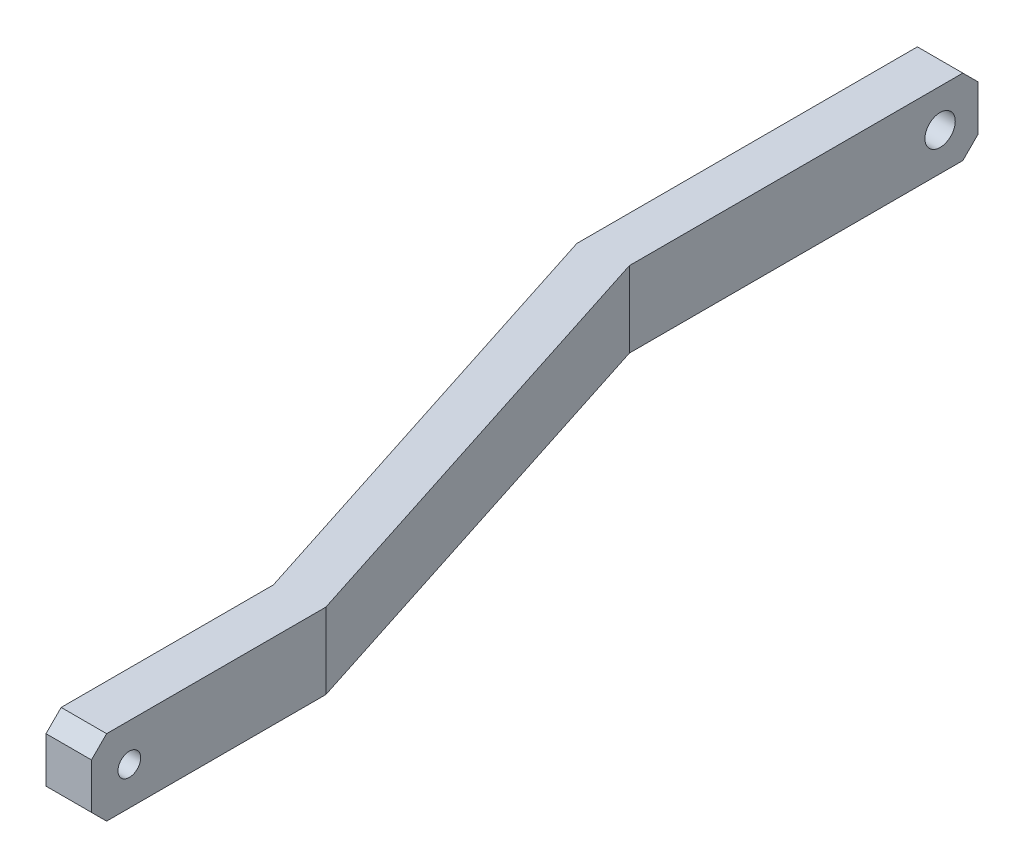
ISO-10303-21;
HEADER;
FILE_DESCRIPTION(('STEP AP214'),'2;1');
FILE_NAME('part.step','',(''),(''),'','','');
FILE_SCHEMA(('AUTOMOTIVE_DESIGN { 1 0 10303 214 1 1 1 1 }'));
ENDSEC;
DATA;
#1=APPLICATION_CONTEXT('core data for automotive mechanical design processes');
#2=APPLICATION_PROTOCOL_DEFINITION('international standard','automotive_design',2000,#1);
#3=PRODUCT_CONTEXT('',#1,'mechanical');
#4=PRODUCT('Part','Part','',(#3));
#5=PRODUCT_RELATED_PRODUCT_CATEGORY('part','',(#4));
#6=PRODUCT_DEFINITION_FORMATION('','',#4);
#7=PRODUCT_DEFINITION_CONTEXT('part definition',#1,'design');
#8=PRODUCT_DEFINITION('design','',#6,#7);
#9=PRODUCT_DEFINITION_SHAPE('','',#8);
#10=(LENGTH_UNIT() NAMED_UNIT(*) SI_UNIT(.MILLI.,.METRE.));
#11=(NAMED_UNIT(*) PLANE_ANGLE_UNIT() SI_UNIT($,.RADIAN.));
#12=(NAMED_UNIT(*) SI_UNIT($,.STERADIAN.) SOLID_ANGLE_UNIT());
#13=UNCERTAINTY_MEASURE_WITH_UNIT(LENGTH_MEASURE(1.E-05),#10,'distance_accuracy_value','');
#14=(GEOMETRIC_REPRESENTATION_CONTEXT(3) GLOBAL_UNCERTAINTY_ASSIGNED_CONTEXT((#13)) GLOBAL_UNIT_ASSIGNED_CONTEXT((#10,
#11,#12)) REPRESENTATION_CONTEXT('',''));
#15=CARTESIAN_POINT('',(0.,0.,0.));
#16=DIRECTION('',(0.,0.,1.));
#17=DIRECTION('',(1.,0.,0.));
#18=AXIS2_PLACEMENT_3D('',#15,#16,#17);
#19=CARTESIAN_POINT('',(-3.,5.,0.));
#20=DIRECTION('',(0.,0.,-1.));
#21=DIRECTION('',(-1.,0.,0.));
#22=AXIS2_PLACEMENT_3D('',#19,#20,#21);
#23=PLANE('',#22);
#24=DIRECTION('',(0.,-1.,0.));
#25=VECTOR('',#24,1.);
#26=CARTESIAN_POINT('',(-3.,5.,0.));
#27=LINE('',#26,#25);
#28=CARTESIAN_POINT('',(-3.,3.99999999999999,0.));
#29=VERTEX_POINT('',#28);
#30=CARTESIAN_POINT('',(-3.,1.00000000000001,0.));
#31=VERTEX_POINT('',#30);
#32=EDGE_CURVE('E159',#29,#31,#27,.T.);
#33=ORIENTED_EDGE('',*,*,#32,.T.);
#34=DIRECTION('',(1.,0.,0.));
#35=VECTOR('',#34,1.);
#36=CARTESIAN_POINT('',(-3.,1.00000000000001,0.));
#37=LINE('',#36,#35);
#38=CARTESIAN_POINT('',(0.,1.00000000000001,0.));
#39=VERTEX_POINT('',#38);
#40=EDGE_CURVE('E189',#31,#39,#37,.T.);
#41=ORIENTED_EDGE('',*,*,#40,.T.);
#42=DIRECTION('',(0.,-1.,0.));
#43=VECTOR('',#42,1.);
#44=CARTESIAN_POINT('',(0.,5.,0.));
#45=LINE('',#44,#43);
#46=CARTESIAN_POINT('',(0.,3.99999999999999,0.));
#47=VERTEX_POINT('',#46);
#48=EDGE_CURVE('E142',#47,#39,#45,.T.);
#49=ORIENTED_EDGE('',*,*,#48,.F.);
#50=DIRECTION('',(-1.,0.,0.));
#51=VECTOR('',#50,1.);
#52=CARTESIAN_POINT('',(-3.,3.99999999999999,0.));
#53=LINE('',#52,#51);
#54=EDGE_CURVE('E187',#47,#29,#53,.T.);
#55=ORIENTED_EDGE('',*,*,#54,.T.);
#56=EDGE_LOOP('',(#33,#41,#49,#55));
#57=FACE_BOUND('',#56,.T.);
#58=ADVANCED_FACE('F32',(#57),#23,.F.);
#59=CARTESIAN_POINT('',(0.,5.,0.));
#60=DIRECTION('',(-1.,0.,0.));
#61=DIRECTION('',(0.,0.,1.));
#62=AXIS2_PLACEMENT_3D('',#59,#60,#61);
#63=PLANE('',#62);
#64=CARTESIAN_POINT('',(0.,2.5,-2.5));
#65=DIRECTION('',(-1.,0.,0.));
#66=DIRECTION('',(0.,0.,1.));
#67=AXIS2_PLACEMENT_3D('',#64,#65,#66);
#68=CIRCLE('',#67,0.75);
#69=CARTESIAN_POINT('',(0.,2.5,-1.75));
#70=VERTEX_POINT('',#69);
#71=EDGE_CURVE('E162',#70,#70,#68,.T.);
#72=ORIENTED_EDGE('',*,*,#71,.T.);
#73=EDGE_LOOP('',(#72));
#74=FACE_BOUND('',#73,.T.);
#75=ORIENTED_EDGE('',*,*,#48,.T.);
#76=DIRECTION('',(0.,0.707106781186548,0.707106781186548));
#77=VECTOR('',#76,1.);
#78=CARTESIAN_POINT('',(0.,1.00000000000001,0.));
#79=LINE('',#78,#77);
#80=CARTESIAN_POINT('',(0.,0.,-1.00000000000001));
#81=VERTEX_POINT('',#80);
#82=EDGE_CURVE('E194',#39,#81,#79,.F.);
#83=ORIENTED_EDGE('',*,*,#82,.T.);
#84=DIRECTION('',(0.,0.,-1.));
#85=VECTOR('',#84,1.);
#86=CARTESIAN_POINT('',(0.,0.,0.));
#87=LINE('',#86,#85);
#88=CARTESIAN_POINT('',(0.,0.,-15.4706920635259));
#89=VERTEX_POINT('',#88);
#90=EDGE_CURVE('E139',#81,#89,#87,.T.);
#91=ORIENTED_EDGE('',*,*,#90,.T.);
#92=DIRECTION('',(0.,-1.,0.));
#93=VECTOR('',#92,1.);
#94=CARTESIAN_POINT('',(0.,5.,-15.4706920635259));
#95=LINE('',#94,#93);
#96=CARTESIAN_POINT('',(0.,5.,-15.4706920635259));
#97=VERTEX_POINT('',#96);
#98=EDGE_CURVE('E135',#97,#89,#95,.T.);
#99=ORIENTED_EDGE('',*,*,#98,.F.);
#100=DIRECTION('',(0.,0.,-1.));
#101=VECTOR('',#100,1.);
#102=CARTESIAN_POINT('',(0.,5.,0.));
#103=LINE('',#102,#101);
#104=CARTESIAN_POINT('',(0.,5.,-1.00000000000001));
#105=VERTEX_POINT('',#104);
#106=EDGE_CURVE('E121',#105,#97,#103,.T.);
#107=ORIENTED_EDGE('',*,*,#106,.F.);
#108=DIRECTION('',(0.,-0.707106781186548,0.707106781186548));
#109=VECTOR('',#108,1.);
#110=CARTESIAN_POINT('',(0.,5.,-1.00000000000001));
#111=LINE('',#110,#109);
#112=EDGE_CURVE('E192',#105,#47,#111,.T.);
#113=ORIENTED_EDGE('',*,*,#112,.T.);
#114=EDGE_LOOP('',(#75,#83,#91,#99,#107,#113));
#115=FACE_BOUND('',#114,.T.);
#116=ADVANCED_FACE('F137',(#74,#115),#63,.F.);
#117=CARTESIAN_POINT('',(0.,5.,-15.4706920635259));
#118=DIRECTION('',(-0.95194929394896,0.,0.306255680355608));
#119=DIRECTION('',(0.306255680355608,0.,0.95194929394896));
#120=AXIS2_PLACEMENT_3D('',#117,#118,#119);
#121=PLANE('',#120);
#122=DIRECTION('',(-0.306255680355608,0.,-0.95194929394896));
#123=VECTOR('',#122,1.);
#124=CARTESIAN_POINT('',(0.,0.,-15.4706920635259));
#125=LINE('',#124,#123);
#126=CARTESIAN_POINT('',(-9.5,0.,-45.));
#127=VERTEX_POINT('',#126);
#128=EDGE_CURVE('E161',#89,#127,#125,.T.);
#129=ORIENTED_EDGE('',*,*,#128,.T.);
#130=DIRECTION('',(0.,-1.,0.));
#131=VECTOR('',#130,1.);
#132=CARTESIAN_POINT('',(-9.5,5.,-45.));
#133=LINE('',#132,#131);
#134=CARTESIAN_POINT('',(-9.5,5.,-45.));
#135=VERTEX_POINT('',#134);
#136=EDGE_CURVE('E143',#135,#127,#133,.T.);
#137=ORIENTED_EDGE('',*,*,#136,.F.);
#138=DIRECTION('',(-0.306255680355608,0.,-0.95194929394896));
#139=VECTOR('',#138,1.);
#140=CARTESIAN_POINT('',(0.,5.,-15.4706920635259));
#141=LINE('',#140,#139);
#142=EDGE_CURVE('E127',#97,#135,#141,.T.);
#143=ORIENTED_EDGE('',*,*,#142,.F.);
#144=ORIENTED_EDGE('',*,*,#98,.T.);
#145=EDGE_LOOP('',(#129,#137,#143,#144));
#146=FACE_BOUND('',#145,.T.);
#147=ADVANCED_FACE('F145',(#146),#121,.F.);
#148=CARTESIAN_POINT('',(-9.5,5.,-45.));
#149=DIRECTION('',(-1.,0.,0.));
#150=DIRECTION('',(0.,0.,1.));
#151=AXIS2_PLACEMENT_3D('',#148,#149,#150);
#152=PLANE('',#151);
#153=CARTESIAN_POINT('',(-9.5,2.5,-65.5));
#154=DIRECTION('',(1.,0.,0.));
#155=DIRECTION('',(0.,0.,-1.));
#156=AXIS2_PLACEMENT_3D('',#153,#154,#155);
#157=CIRCLE('',#156,0.999999999999998);
#158=CARTESIAN_POINT('',(-9.5,2.5,-66.5));
#159=VERTEX_POINT('',#158);
#160=EDGE_CURVE('E382',#159,#159,#157,.T.);
#161=ORIENTED_EDGE('',*,*,#160,.F.);
#162=EDGE_LOOP('',(#161));
#163=FACE_BOUND('',#162,.T.);
#164=DIRECTION('',(0.,-1.,0.));
#165=VECTOR('',#164,1.);
#166=CARTESIAN_POINT('',(-9.5,5.,-68.));
#167=LINE('',#166,#165);
#168=CARTESIAN_POINT('',(-9.5,4.00000000000001,-68.));
#169=VERTEX_POINT('',#168);
#170=CARTESIAN_POINT('',(-9.5,1.00000000000001,-68.));
#171=VERTEX_POINT('',#170);
#172=EDGE_CURVE('E183',#169,#171,#167,.T.);
#173=ORIENTED_EDGE('',*,*,#172,.F.);
#174=DIRECTION('',(0.,0.707106781186545,0.70710678118655));
#175=VECTOR('',#174,1.);
#176=CARTESIAN_POINT('',(-9.5,5.,-67.));
#177=LINE('',#176,#175);
#178=CARTESIAN_POINT('',(-9.5,5.,-67.));
#179=VERTEX_POINT('',#178);
#180=EDGE_CURVE('E11',#169,#179,#177,.T.);
#181=ORIENTED_EDGE('',*,*,#180,.T.);
#182=DIRECTION('',(0.,0.,-1.));
#183=VECTOR('',#182,1.);
#184=CARTESIAN_POINT('',(-9.5,5.,-45.));
#185=LINE('',#184,#183);
#186=EDGE_CURVE('E148',#135,#179,#185,.T.);
#187=ORIENTED_EDGE('',*,*,#186,.F.);
#188=ORIENTED_EDGE('',*,*,#136,.T.);
#189=DIRECTION('',(0.,0.,-1.));
#190=VECTOR('',#189,1.);
#191=CARTESIAN_POINT('',(-9.5,0.,-45.));
#192=LINE('',#191,#190);
#193=CARTESIAN_POINT('',(-9.5,0.,-67.));
#194=VERTEX_POINT('',#193);
#195=EDGE_CURVE('E164',#127,#194,#192,.T.);
#196=ORIENTED_EDGE('',*,*,#195,.T.);
#197=DIRECTION('',(0.,-0.70710678118655,0.707106781186545));
#198=VECTOR('',#197,1.);
#199=CARTESIAN_POINT('',(-9.5,1.00000000000001,-68.));
#200=LINE('',#199,#198);
#201=EDGE_CURVE('E40',#194,#171,#200,.F.);
#202=ORIENTED_EDGE('',*,*,#201,.T.);
#203=EDGE_LOOP('',(#173,#181,#187,#188,#196,#202));
#204=FACE_BOUND('',#203,.T.);
#205=ADVANCED_FACE('F227',(#163,#204),#152,.F.);
#206=CARTESIAN_POINT('',(-9.5,5.,-68.));
#207=DIRECTION('',(0.,0.,1.));
#208=DIRECTION('',(1.,0.,0.));
#209=AXIS2_PLACEMENT_3D('',#206,#207,#208);
#210=PLANE('',#209);
#211=DIRECTION('',(0.,-1.,0.));
#212=VECTOR('',#211,1.);
#213=CARTESIAN_POINT('',(-12.5,5.,-68.));
#214=LINE('',#213,#212);
#215=CARTESIAN_POINT('',(-12.5,4.00000000000001,-68.));
#216=VERTEX_POINT('',#215);
#217=CARTESIAN_POINT('',(-12.5,1.00000000000001,-68.));
#218=VERTEX_POINT('',#217);
#219=EDGE_CURVE('E180',#216,#218,#214,.T.);
#220=ORIENTED_EDGE('',*,*,#219,.F.);
#221=DIRECTION('',(1.,0.,0.));
#222=VECTOR('',#221,1.);
#223=CARTESIAN_POINT('',(-9.5,4.00000000000001,-68.));
#224=LINE('',#223,#222);
#225=EDGE_CURVE('E53',#216,#169,#224,.T.);
#226=ORIENTED_EDGE('',*,*,#225,.T.);
#227=ORIENTED_EDGE('',*,*,#172,.T.);
#228=DIRECTION('',(-1.,0.,0.));
#229=VECTOR('',#228,1.);
#230=CARTESIAN_POINT('',(-9.5,1.00000000000001,-68.));
#231=LINE('',#230,#229);
#232=EDGE_CURVE('E212',#171,#218,#231,.T.);
#233=ORIENTED_EDGE('',*,*,#232,.T.);
#234=EDGE_LOOP('',(#220,#226,#227,#233));
#235=FACE_BOUND('',#234,.T.);
#236=ADVANCED_FACE('F216',(#235),#210,.F.);
#237=CARTESIAN_POINT('',(-12.5,5.,-68.));
#238=DIRECTION('',(1.,0.,0.));
#239=DIRECTION('',(0.,0.,-1.));
#240=AXIS2_PLACEMENT_3D('',#237,#238,#239);
#241=PLANE('',#240);
#242=CARTESIAN_POINT('',(-12.5,2.5,-65.5));
#243=DIRECTION('',(1.,0.,0.));
#244=DIRECTION('',(0.,0.,-1.));
#245=AXIS2_PLACEMENT_3D('',#242,#243,#244);
#246=CIRCLE('',#245,0.999999999999998);
#247=CARTESIAN_POINT('',(-12.5,2.5,-66.5));
#248=VERTEX_POINT('',#247);
#249=EDGE_CURVE('E379',#248,#248,#246,.T.);
#250=ORIENTED_EDGE('',*,*,#249,.T.);
#251=EDGE_LOOP('',(#250));
#252=FACE_BOUND('',#251,.T.);
#253=DIRECTION('',(0.,0.,1.));
#254=VECTOR('',#253,1.);
#255=CARTESIAN_POINT('',(-12.5,5.,-68.));
#256=LINE('',#255,#254);
#257=CARTESIAN_POINT('',(-12.5,5.,-67.));
#258=VERTEX_POINT('',#257);
#259=CARTESIAN_POINT('',(-12.5,5.,-44.5293079364741));
#260=VERTEX_POINT('',#259);
#261=EDGE_CURVE('E150',#258,#260,#256,.T.);
#262=ORIENTED_EDGE('',*,*,#261,.F.);
#263=DIRECTION('',(0.,-0.707106781186545,-0.70710678118655));
#264=VECTOR('',#263,1.);
#265=CARTESIAN_POINT('',(-12.5,5.,-67.));
#266=LINE('',#265,#264);
#267=EDGE_CURVE('E210',#258,#216,#266,.T.);
#268=ORIENTED_EDGE('',*,*,#267,.T.);
#269=ORIENTED_EDGE('',*,*,#219,.T.);
#270=DIRECTION('',(0.,0.70710678118655,-0.707106781186545));
#271=VECTOR('',#270,1.);
#272=CARTESIAN_POINT('',(-12.5,1.00000000000001,-68.));
#273=LINE('',#272,#271);
#274=CARTESIAN_POINT('',(-12.5,0.,-67.));
#275=VERTEX_POINT('',#274);
#276=EDGE_CURVE('E208',#218,#275,#273,.F.);
#277=ORIENTED_EDGE('',*,*,#276,.T.);
#278=DIRECTION('',(0.,0.,1.));
#279=VECTOR('',#278,1.);
#280=CARTESIAN_POINT('',(-12.5,0.,-68.));
#281=LINE('',#280,#279);
#282=CARTESIAN_POINT('',(-12.5,0.,-44.5293079364741));
#283=VERTEX_POINT('',#282);
#284=EDGE_CURVE('E166',#275,#283,#281,.T.);
#285=ORIENTED_EDGE('',*,*,#284,.T.);
#286=DIRECTION('',(0.,-1.,0.));
#287=VECTOR('',#286,1.);
#288=CARTESIAN_POINT('',(-12.5,5.,-44.5293079364741));
#289=LINE('',#288,#287);
#290=EDGE_CURVE('E177',#260,#283,#289,.T.);
#291=ORIENTED_EDGE('',*,*,#290,.F.);
#292=EDGE_LOOP('',(#262,#268,#269,#277,#285,#291));
#293=FACE_BOUND('',#292,.T.);
#294=ADVANCED_FACE('F220',(#252,#293),#241,.F.);
#295=CARTESIAN_POINT('',(-12.5,5.,-44.5293079364741));
#296=DIRECTION('',(0.95194929394896,0.,-0.306255680355608));
#297=DIRECTION('',(-0.306255680355608,0.,-0.95194929394896));
#298=AXIS2_PLACEMENT_3D('',#295,#296,#297);
#299=PLANE('',#298);
#300=DIRECTION('',(0.306255680355608,0.,0.95194929394896));
#301=VECTOR('',#300,1.);
#302=CARTESIAN_POINT('',(-12.5,0.,-44.5293079364741));
#303=LINE('',#302,#301);
#304=CARTESIAN_POINT('',(-3.,0.,-15.));
#305=VERTEX_POINT('',#304);
#306=EDGE_CURVE('E168',#283,#305,#303,.T.);
#307=ORIENTED_EDGE('',*,*,#306,.T.);
#308=DIRECTION('',(0.,-1.,0.));
#309=VECTOR('',#308,1.);
#310=CARTESIAN_POINT('',(-3.,5.,-15.));
#311=LINE('',#310,#309);
#312=CARTESIAN_POINT('',(-3.,5.,-15.));
#313=VERTEX_POINT('',#312);
#314=EDGE_CURVE('E174',#313,#305,#311,.T.);
#315=ORIENTED_EDGE('',*,*,#314,.F.);
#316=DIRECTION('',(0.306255680355608,0.,0.95194929394896));
#317=VECTOR('',#316,1.);
#318=CARTESIAN_POINT('',(-12.5,5.,-44.5293079364741));
#319=LINE('',#318,#317);
#320=EDGE_CURVE('E155',#260,#313,#319,.T.);
#321=ORIENTED_EDGE('',*,*,#320,.F.);
#322=ORIENTED_EDGE('',*,*,#290,.T.);
#323=EDGE_LOOP('',(#307,#315,#321,#322));
#324=FACE_BOUND('',#323,.T.);
#325=ADVANCED_FACE('F266',(#324),#299,.F.);
#326=CARTESIAN_POINT('',(-3.,5.,-15.));
#327=DIRECTION('',(1.,0.,0.));
#328=DIRECTION('',(0.,0.,-1.));
#329=AXIS2_PLACEMENT_3D('',#326,#327,#328);
#330=PLANE('',#329);
#331=CARTESIAN_POINT('',(-3.,2.5,-2.5));
#332=DIRECTION('',(-1.,0.,0.));
#333=DIRECTION('',(0.,0.,1.));
#334=AXIS2_PLACEMENT_3D('',#331,#332,#333);
#335=CIRCLE('',#334,0.75);
#336=CARTESIAN_POINT('',(-3.,2.5,-1.75));
#337=VERTEX_POINT('',#336);
#338=EDGE_CURVE('E378',#337,#337,#335,.T.);
#339=ORIENTED_EDGE('',*,*,#338,.F.);
#340=EDGE_LOOP('',(#339));
#341=FACE_BOUND('',#340,.T.);
#342=DIRECTION('',(0.,0.,1.));
#343=VECTOR('',#342,1.);
#344=CARTESIAN_POINT('',(-3.,0.,-15.));
#345=LINE('',#344,#343);
#346=CARTESIAN_POINT('',(-3.,0.,-1.00000000000001));
#347=VERTEX_POINT('',#346);
#348=EDGE_CURVE('E132',#305,#347,#345,.T.);
#349=ORIENTED_EDGE('',*,*,#348,.T.);
#350=DIRECTION('',(0.,-0.707106781186548,-0.707106781186548));
#351=VECTOR('',#350,1.);
#352=CARTESIAN_POINT('',(-3.,1.00000000000001,0.));
#353=LINE('',#352,#351);
#354=EDGE_CURVE('E202',#347,#31,#353,.F.);
#355=ORIENTED_EDGE('',*,*,#354,.T.);
#356=ORIENTED_EDGE('',*,*,#32,.F.);
#357=DIRECTION('',(0.,0.707106781186548,-0.707106781186548));
#358=VECTOR('',#357,1.);
#359=CARTESIAN_POINT('',(-3.,5.,-1.00000000000001));
#360=LINE('',#359,#358);
#361=CARTESIAN_POINT('',(-3.,5.,-1.00000000000001));
#362=VERTEX_POINT('',#361);
#363=EDGE_CURVE('E200',#29,#362,#360,.T.);
#364=ORIENTED_EDGE('',*,*,#363,.T.);
#365=DIRECTION('',(0.,0.,1.));
#366=VECTOR('',#365,1.);
#367=CARTESIAN_POINT('',(-3.,5.,-15.));
#368=LINE('',#367,#366);
#369=EDGE_CURVE('E157',#313,#362,#368,.T.);
#370=ORIENTED_EDGE('',*,*,#369,.F.);
#371=ORIENTED_EDGE('',*,*,#314,.T.);
#372=EDGE_LOOP('',(#349,#355,#356,#364,#370,#371));
#373=FACE_BOUND('',#372,.T.);
#374=ADVANCED_FACE('F262',(#341,#373),#330,.F.);
#375=CARTESIAN_POINT('',(0.,5.,0.));
#376=DIRECTION('',(0.,1.,0.));
#377=DIRECTION('',(0.,0.,1.));
#378=AXIS2_PLACEMENT_3D('',#375,#376,#377);
#379=PLANE('',#378);
#380=ORIENTED_EDGE('',*,*,#369,.T.);
#381=DIRECTION('',(1.,0.,0.));
#382=VECTOR('',#381,1.);
#383=CARTESIAN_POINT('',(0.,5.,-1.00000000000001));
#384=LINE('',#383,#382);
#385=EDGE_CURVE('E130',#362,#105,#384,.T.);
#386=ORIENTED_EDGE('',*,*,#385,.T.);
#387=ORIENTED_EDGE('',*,*,#106,.T.);
#388=ORIENTED_EDGE('',*,*,#142,.T.);
#389=ORIENTED_EDGE('',*,*,#186,.T.);
#390=DIRECTION('',(-1.,0.,0.));
#391=VECTOR('',#390,1.);
#392=CARTESIAN_POINT('',(-12.5,5.,-67.));
#393=LINE('',#392,#391);
#394=EDGE_CURVE('E204',#179,#258,#393,.T.);
#395=ORIENTED_EDGE('',*,*,#394,.T.);
#396=ORIENTED_EDGE('',*,*,#261,.T.);
#397=ORIENTED_EDGE('',*,*,#320,.T.);
#398=EDGE_LOOP('',(#380,#386,#387,#388,#389,#395,#396,#397));
#399=FACE_BOUND('',#398,.T.);
#400=ADVANCED_FACE('F124',(#399),#379,.T.);
#401=CARTESIAN_POINT('',(0.,0.,0.));
#402=DIRECTION('',(0.,1.,0.));
#403=DIRECTION('',(0.,0.,1.));
#404=AXIS2_PLACEMENT_3D('',#401,#402,#403);
#405=PLANE('',#404);
#406=ORIENTED_EDGE('',*,*,#90,.F.);
#407=DIRECTION('',(-1.,0.,0.));
#408=VECTOR('',#407,1.);
#409=CARTESIAN_POINT('',(0.,0.,-1.00000000000001));
#410=LINE('',#409,#408);
#411=EDGE_CURVE('E198',#81,#347,#410,.T.);
#412=ORIENTED_EDGE('',*,*,#411,.T.);
#413=ORIENTED_EDGE('',*,*,#348,.F.);
#414=ORIENTED_EDGE('',*,*,#306,.F.);
#415=ORIENTED_EDGE('',*,*,#284,.F.);
#416=DIRECTION('',(1.,0.,0.));
#417=VECTOR('',#416,1.);
#418=CARTESIAN_POINT('',(0.,0.,-67.));
#419=LINE('',#418,#417);
#420=EDGE_CURVE('E196',#275,#194,#419,.T.);
#421=ORIENTED_EDGE('',*,*,#420,.T.);
#422=ORIENTED_EDGE('',*,*,#195,.F.);
#423=ORIENTED_EDGE('',*,*,#128,.F.);
#424=EDGE_LOOP('',(#406,#412,#413,#414,#415,#421,#422,#423));
#425=FACE_BOUND('',#424,.T.);
#426=ADVANCED_FACE('F230',(#425),#405,.F.);
#427=CARTESIAN_POINT('',(0.,2.5,-2.5));
#428=DIRECTION('',(-1.,0.,0.));
#429=DIRECTION('',(0.,0.,1.));
#430=AXIS2_PLACEMENT_3D('',#427,#428,#429);
#431=CYLINDRICAL_SURFACE('',#430,0.75);
#432=ORIENTED_EDGE('',*,*,#71,.F.);
#433=EDGE_LOOP('',(#432));
#434=FACE_BOUND('',#433,.T.);
#435=ORIENTED_EDGE('',*,*,#338,.T.);
#436=EDGE_LOOP('',(#435));
#437=FACE_BOUND('',#436,.T.);
#438=ADVANCED_FACE('F329',(#434,#437),#431,.F.);
#439=CARTESIAN_POINT('',(-12.5,2.5,-65.5));
#440=DIRECTION('',(1.,0.,0.));
#441=DIRECTION('',(0.,0.,-1.));
#442=AXIS2_PLACEMENT_3D('',#439,#440,#441);
#443=CYLINDRICAL_SURFACE('',#442,0.999999999999998);
#444=ORIENTED_EDGE('',*,*,#249,.F.);
#445=EDGE_LOOP('',(#444));
#446=FACE_BOUND('',#445,.T.);
#447=ORIENTED_EDGE('',*,*,#160,.T.);
#448=EDGE_LOOP('',(#447));
#449=FACE_BOUND('',#448,.T.);
#450=ADVANCED_FACE('F251',(#446,#449),#443,.F.);
#451=CARTESIAN_POINT('',(-3.,1.00000000000001,0.));
#452=DIRECTION('',(0.,0.707106781186547,-0.707106781186547));
#453=DIRECTION('',(1.,0.,0.));
#454=AXIS2_PLACEMENT_3D('',#451,#452,#453);
#455=PLANE('',#454);
#456=ORIENTED_EDGE('',*,*,#354,.F.);
#457=ORIENTED_EDGE('',*,*,#411,.F.);
#458=ORIENTED_EDGE('',*,*,#82,.F.);
#459=ORIENTED_EDGE('',*,*,#40,.F.);
#460=EDGE_LOOP('',(#456,#457,#458,#459));
#461=FACE_BOUND('',#460,.T.);
#462=ADVANCED_FACE('F248',(#461),#455,.F.);
#463=CARTESIAN_POINT('',(0.,5.,-1.00000000000001));
#464=DIRECTION('',(0.,0.707106781186547,0.707106781186547));
#465=DIRECTION('',(-1.,0.,0.));
#466=AXIS2_PLACEMENT_3D('',#463,#464,#465);
#467=PLANE('',#466);
#468=ORIENTED_EDGE('',*,*,#363,.F.);
#469=ORIENTED_EDGE('',*,*,#54,.F.);
#470=ORIENTED_EDGE('',*,*,#112,.F.);
#471=ORIENTED_EDGE('',*,*,#385,.F.);
#472=EDGE_LOOP('',(#468,#469,#470,#471));
#473=FACE_BOUND('',#472,.T.);
#474=ADVANCED_FACE('F237',(#473),#467,.T.);
#475=CARTESIAN_POINT('',(0.,5.,-67.));
#476=DIRECTION('',(0.,0.70710678118655,-0.707106781186545));
#477=DIRECTION('',(1.,0.,0.));
#478=AXIS2_PLACEMENT_3D('',#475,#476,#477);
#479=PLANE('',#478);
#480=ORIENTED_EDGE('',*,*,#180,.F.);
#481=ORIENTED_EDGE('',*,*,#225,.F.);
#482=ORIENTED_EDGE('',*,*,#267,.F.);
#483=ORIENTED_EDGE('',*,*,#394,.F.);
#484=EDGE_LOOP('',(#480,#481,#482,#483));
#485=FACE_BOUND('',#484,.T.);
#486=ADVANCED_FACE('F226',(#485),#479,.T.);
#487=CARTESIAN_POINT('',(-9.5,1.00000000000001,-68.));
#488=DIRECTION('',(0.,0.707106781186545,0.70710678118655));
#489=DIRECTION('',(-1.,0.,0.));
#490=AXIS2_PLACEMENT_3D('',#487,#488,#489);
#491=PLANE('',#490);
#492=ORIENTED_EDGE('',*,*,#201,.F.);
#493=ORIENTED_EDGE('',*,*,#420,.F.);
#494=ORIENTED_EDGE('',*,*,#276,.F.);
#495=ORIENTED_EDGE('',*,*,#232,.F.);
#496=EDGE_LOOP('',(#492,#493,#494,#495));
#497=FACE_BOUND('',#496,.T.);
#498=ADVANCED_FACE('F34',(#497),#491,.F.);
#499=CLOSED_SHELL('',(#58,#116,#147,#205,#236,#294,#325,#374,#400,#426,#438,#450,#462,#474,#486,#498));
#500=MANIFOLD_SOLID_BREP('B2',#499);
#501=ADVANCED_BREP_SHAPE_REPRESENTATION('',(#18,#500),#14);
#502=SHAPE_DEFINITION_REPRESENTATION(#9,#501);
ENDSEC;
END-ISO-10303-21;
